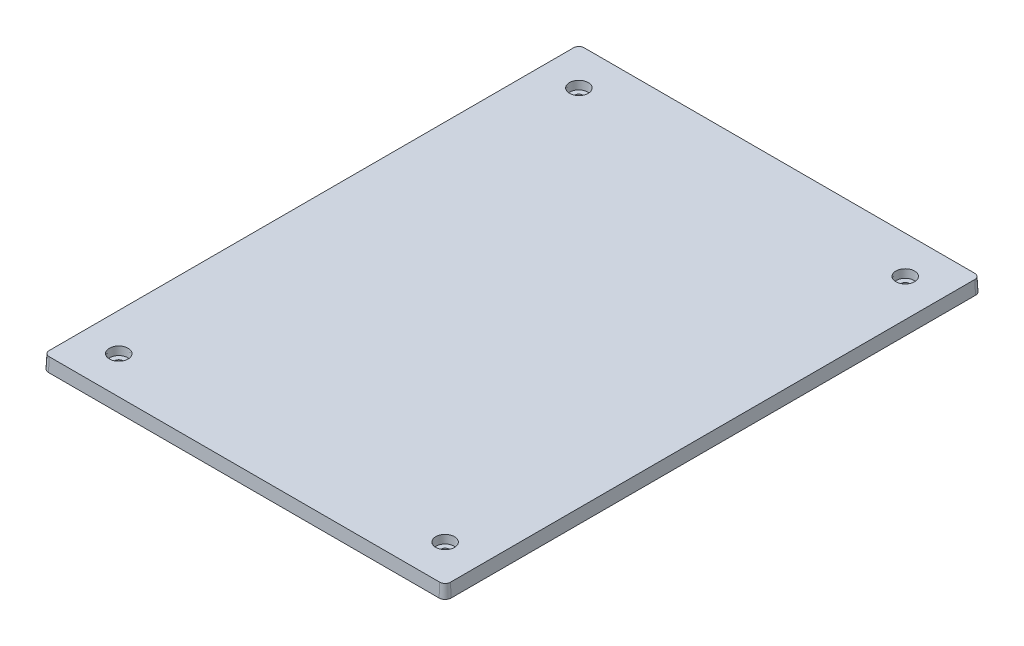
ISO-10303-21;
HEADER;
FILE_DESCRIPTION(('STEP AP214'),'2;1');
FILE_NAME('part.step','',(''),(''),'','','');
FILE_SCHEMA(('AUTOMOTIVE_DESIGN { 1 0 10303 214 1 1 1 1 }'));
ENDSEC;
DATA;
#1=APPLICATION_CONTEXT('core data for automotive mechanical design processes');
#2=APPLICATION_PROTOCOL_DEFINITION('international standard','automotive_design',2000,#1);
#3=PRODUCT_CONTEXT('',#1,'mechanical');
#4=PRODUCT('Part','Part','',(#3));
#5=PRODUCT_RELATED_PRODUCT_CATEGORY('part','',(#4));
#6=PRODUCT_DEFINITION_FORMATION('','',#4);
#7=PRODUCT_DEFINITION_CONTEXT('part definition',#1,'design');
#8=PRODUCT_DEFINITION('design','',#6,#7);
#9=PRODUCT_DEFINITION_SHAPE('','',#8);
#10=(LENGTH_UNIT() NAMED_UNIT(*) SI_UNIT(.MILLI.,.METRE.));
#11=(NAMED_UNIT(*) PLANE_ANGLE_UNIT() SI_UNIT($,.RADIAN.));
#12=(NAMED_UNIT(*) SI_UNIT($,.STERADIAN.) SOLID_ANGLE_UNIT());
#13=UNCERTAINTY_MEASURE_WITH_UNIT(LENGTH_MEASURE(1.E-05),#10,'distance_accuracy_value','');
#14=(GEOMETRIC_REPRESENTATION_CONTEXT(3) GLOBAL_UNCERTAINTY_ASSIGNED_CONTEXT((#13)) GLOBAL_UNIT_ASSIGNED_CONTEXT((#10,
#11,#12)) REPRESENTATION_CONTEXT('',''));
#15=CARTESIAN_POINT('',(0.,0.,0.));
#16=DIRECTION('',(0.,0.,1.));
#17=DIRECTION('',(1.,0.,0.));
#18=AXIS2_PLACEMENT_3D('',#15,#16,#17);
#19=CARTESIAN_POINT('',(-211.142788133925,5.,-160.073110132883));
#20=DIRECTION('',(0.,1.,0.));
#21=DIRECTION('',(0.,0.,1.));
#22=AXIS2_PLACEMENT_3D('',#19,#20,#21);
#23=CONICAL_SURFACE('',#22,1.59999999999999,0.05235987755983);
#24=CARTESIAN_POINT('',(-211.142788133925,0.,-160.073110132883));
#25=DIRECTION('',(0.,1.,0.));
#26=DIRECTION('',(0.,0.,1.));
#27=AXIS2_PLACEMENT_3D('',#24,#25,#26);
#28=CIRCLE('',#27,1.33796110358478);
#29=CARTESIAN_POINT('',(-211.142788133925,0.,-158.735149029298));
#30=VERTEX_POINT('',#29);
#31=EDGE_CURVE('E204',#30,#30,#28,.F.);
#32=ORIENTED_EDGE('',*,*,#31,.T.);
#33=EDGE_LOOP('',(#32));
#34=FACE_BOUND('',#33,.T.);
#35=CARTESIAN_POINT('',(-211.142788133925,2.,-160.073110132883));
#36=DIRECTION('',(0.,1.,0.));
#37=DIRECTION('',(0.,0.,1.));
#38=AXIS2_PLACEMENT_3D('',#35,#36,#37);
#39=CIRCLE('',#38,1.44277666215086);
#40=CARTESIAN_POINT('',(-211.142788133925,2.,-158.630333470732));
#41=VERTEX_POINT('',#40);
#42=EDGE_CURVE('E41',#41,#41,#39,.F.);
#43=ORIENTED_EDGE('',*,*,#42,.F.);
#44=EDGE_LOOP('',(#43));
#45=FACE_BOUND('',#44,.T.);
#46=ADVANCED_FACE('F37',(#34,#45),#23,.F.);
#47=CARTESIAN_POINT('',(-333.142788133925,5.,11.9268898671168));
#48=DIRECTION('',(0.,1.,0.));
#49=DIRECTION('',(0.,0.,1.));
#50=AXIS2_PLACEMENT_3D('',#47,#48,#49);
#51=CONICAL_SURFACE('',#50,1.59999999999996,0.05235987755983);
#52=CARTESIAN_POINT('',(-333.142788133925,0.,11.9268898671168));
#53=DIRECTION('',(0.,1.,0.));
#54=DIRECTION('',(0.,0.,1.));
#55=AXIS2_PLACEMENT_3D('',#52,#53,#54);
#56=CIRCLE('',#55,1.33796110358476);
#57=CARTESIAN_POINT('',(-333.142788133925,0.,13.2648509707016));
#58=VERTEX_POINT('',#57);
#59=EDGE_CURVE('E231',#58,#58,#56,.F.);
#60=ORIENTED_EDGE('',*,*,#59,.T.);
#61=EDGE_LOOP('',(#60));
#62=FACE_BOUND('',#61,.T.);
#63=CARTESIAN_POINT('',(-333.142788133925,2.,11.9268898671168));
#64=DIRECTION('',(0.,1.,0.));
#65=DIRECTION('',(0.,0.,1.));
#66=AXIS2_PLACEMENT_3D('',#63,#64,#65);
#67=CIRCLE('',#66,1.44277666215084);
#68=CARTESIAN_POINT('',(-333.142788133925,2.,13.3696665292676));
#69=VERTEX_POINT('',#68);
#70=EDGE_CURVE('E228',#69,#69,#67,.F.);
#71=ORIENTED_EDGE('',*,*,#70,.F.);
#72=EDGE_LOOP('',(#71));
#73=FACE_BOUND('',#72,.T.);
#74=ADVANCED_FACE('F317',(#62,#73),#51,.F.);
#75=CARTESIAN_POINT('',(-211.142788133925,5.,11.9268898671168));
#76=DIRECTION('',(0.,1.,0.));
#77=DIRECTION('',(0.,0.,1.));
#78=AXIS2_PLACEMENT_3D('',#75,#76,#77);
#79=CONICAL_SURFACE('',#78,1.60000000000002,0.05235987755983);
#80=CARTESIAN_POINT('',(-211.142788133925,0.,11.9268898671168));
#81=DIRECTION('',(0.,1.,0.));
#82=DIRECTION('',(0.,0.,1.));
#83=AXIS2_PLACEMENT_3D('',#80,#81,#82);
#84=CIRCLE('',#83,1.33796110358481);
#85=CARTESIAN_POINT('',(-211.142788133925,0.,13.2648509707016));
#86=VERTEX_POINT('',#85);
#87=EDGE_CURVE('E212',#86,#86,#84,.F.);
#88=ORIENTED_EDGE('',*,*,#87,.T.);
#89=EDGE_LOOP('',(#88));
#90=FACE_BOUND('',#89,.T.);
#91=CARTESIAN_POINT('',(-211.142788133925,2.,11.9268898671168));
#92=DIRECTION('',(0.,1.,0.));
#93=DIRECTION('',(0.,0.,1.));
#94=AXIS2_PLACEMENT_3D('',#91,#92,#93);
#95=CIRCLE('',#94,1.4427766621509);
#96=CARTESIAN_POINT('',(-211.142788133925,2.,13.3696665292677));
#97=VERTEX_POINT('',#96);
#98=EDGE_CURVE('E221',#97,#97,#95,.F.);
#99=ORIENTED_EDGE('',*,*,#98,.F.);
#100=EDGE_LOOP('',(#99));
#101=FACE_BOUND('',#100,.T.);
#102=ADVANCED_FACE('F313',(#90,#101),#79,.F.);
#103=CARTESIAN_POINT('',(-333.142788133925,5.,-160.073110132883));
#104=DIRECTION('',(0.,1.,0.));
#105=DIRECTION('',(0.,0.,1.));
#106=AXIS2_PLACEMENT_3D('',#103,#104,#105);
#107=CONICAL_SURFACE('',#106,1.59999999999996,0.05235987755983);
#108=CARTESIAN_POINT('',(-333.142788133925,0.,-160.073110132883));
#109=DIRECTION('',(0.,1.,0.));
#110=DIRECTION('',(0.,0.,1.));
#111=AXIS2_PLACEMENT_3D('',#108,#109,#110);
#112=CIRCLE('',#111,1.33796110358476);
#113=CARTESIAN_POINT('',(-333.142788133925,0.,-158.735149029298));
#114=VERTEX_POINT('',#113);
#115=EDGE_CURVE('E208',#114,#114,#112,.F.);
#116=ORIENTED_EDGE('',*,*,#115,.T.);
#117=EDGE_LOOP('',(#116));
#118=FACE_BOUND('',#117,.T.);
#119=CARTESIAN_POINT('',(-333.142788133925,2.,-160.073110132883));
#120=DIRECTION('',(0.,1.,0.));
#121=DIRECTION('',(0.,0.,1.));
#122=AXIS2_PLACEMENT_3D('',#119,#120,#121);
#123=CIRCLE('',#122,1.44277666215084);
#124=CARTESIAN_POINT('',(-333.142788133925,2.,-158.630333470732));
#125=VERTEX_POINT('',#124);
#126=EDGE_CURVE('E218',#125,#125,#123,.F.);
#127=ORIENTED_EDGE('',*,*,#126,.F.);
#128=EDGE_LOOP('',(#127));
#129=FACE_BOUND('',#128,.T.);
#130=ADVANCED_FACE('F308',(#118,#129),#107,.F.);
#131=CARTESIAN_POINT('',(-345.145529064416,-1.,-174.387556808581));
#132=CARTESIAN_POINT('',(-345.752795620197,-1.00000000000068,-174.387556808683));
#133=CARTESIAN_POINT('',(-346.3526203948,-1.,-174.138668215172));
#134=CARTESIAN_POINT('',(-347.208346216213,-1.,-173.282942393759));
#135=CARTESIAN_POINT('',(-347.457234809681,-1.00000000000068,-172.683117619156));
#136=CARTESIAN_POINT('',(-347.457234809623,-1.,-172.075851063374));
#137=CARTESIAN_POINT('',(-345.145529064416,5.,-174.073110132883));
#138=CARTESIAN_POINT('',(-345.670400123873,5.,-174.073110132876));
#139=CARTESIAN_POINT('',(-346.188541300976,5.,-173.858052555574));
#140=CARTESIAN_POINT('',(-346.927730556622,5.,-173.118863299941));
#141=CARTESIAN_POINT('',(-347.142788133866,5.,-172.600722122826));
#142=CARTESIAN_POINT('',(-347.142788133925,5.,-172.075851063374));
#143=B_SPLINE_SURFACE_WITH_KNOTS('',1,3,((#131,#132,#133,#134,#135,#136),(#137,#138,#139,#140,
#141,#142)),.UNSPECIFIED.,.F.,.F.,.F.,(2,2),(4,2,4),(0.,1.),(5.49915667165253,6.28318530717959,
7.06721394270664),.UNSPECIFIED.);
#144=CARTESIAN_POINT('',(-345.145529064419,0.,-174.335149029298));
#145=CARTESIAN_POINT('',(-345.273080732209,0.,-174.335176175184));
#146=CARTESIAN_POINT('',(-345.400490163894,0.,-174.323917418397));
#147=CARTESIAN_POINT('',(-345.651723437775,0.,-174.280147968457));
#148=CARTESIAN_POINT('',(-345.775544561616,0.,-174.247621581765));
#149=CARTESIAN_POINT('',(-346.015979416877,0.,-174.162683806524));
#150=CARTESIAN_POINT('',(-346.132600342668,0.,-174.110292653209));
#151=CARTESIAN_POINT('',(-346.355556092321,0.,-173.986920718033));
#152=CARTESIAN_POINT('',(-346.461898830093,0.,-173.915954397192));
#153=CARTESIAN_POINT('',(-346.61162776885,0.,-173.796355045471));
#154=CARTESIAN_POINT('',(-346.660153043364,0.,-173.754019049609));
#155=CARTESIAN_POINT('',(-346.753262536115,0.,-173.665192489724));
#156=CARTESIAN_POINT('',(-346.797846827515,0.,-173.618702002861));
#157=CARTESIAN_POINT('',(-346.882777866003,0.,-173.521965107104));
#158=CARTESIAN_POINT('',(-346.923122547904,0.,-173.471716887964));
#159=CARTESIAN_POINT('',(-346.999346833647,0.,-173.367957957496));
#160=CARTESIAN_POINT('',(-347.035226253117,0.,-173.314447111589));
#161=CARTESIAN_POINT('',(-347.13364650812,0.,-173.153311889042));
#162=CARTESIAN_POINT('',(-347.189865265387,0.,-173.041739945239));
#163=CARTESIAN_POINT('',(-347.283599690943,0.,-172.811128212293));
#164=CARTESIAN_POINT('',(-347.321130512744,0.,-172.692094562114));
#165=CARTESIAN_POINT('',(-347.367215755915,0.,-172.489663411313));
#166=CARTESIAN_POINT('',(-347.38124664655,0.,-172.407482715691));
#167=CARTESIAN_POINT('',(-347.400048395247,0.,-172.242170368379));
#168=CARTESIAN_POINT('',(-347.404830037697,0.,-172.15903993801));
#169=CARTESIAN_POINT('',(-347.40482703034,0.,-172.075851063374));
#170=B_SPLINE_CURVE_WITH_KNOTS('',3,(#144,#145,#146,#147,#148,#149,#150,#151,#152,#153,#154,
#155,#156,#157,#158,#159,#160,#161,#162,#163,#164,#165,#166,#167,#168,#169),.UNSPECIFIED.,.F.,
.F.,(4,2,2,2,2,2,2,2,2,2,2,2,4),(0.,0.381968936282809,0.764220048803127,1.14608282300535,
1.52764919153551,1.72063122309064,1.91360967122549,2.10668169098715,2.29976168015199,
2.67281522812565,3.04556578300755,3.29518745617468,3.54451790093966),.UNSPECIFIED.);
#171=CARTESIAN_POINT('',(-345.145529064419,0.,-174.335149029298));
#172=VERTEX_POINT('',#171);
#173=CARTESIAN_POINT('',(-347.40482703034,0.,-172.075851063374));
#174=VERTEX_POINT('',#173);
#175=EDGE_CURVE('E111',#172,#174,#170,.T.);
#176=DIRECTION('',(-0.0523359562429439,-0.998629534754574,0.));
#177=VECTOR('',#176,1.);
#178=CARTESIAN_POINT('',(-347.142788133925,5.,-172.075851063374));
#179=LINE('',#178,#177);
#180=CARTESIAN_POINT('',(-347.142788133925,5.,-172.075851063374));
#181=VERTEX_POINT('',#180);
#182=EDGE_CURVE('E11',#181,#174,#179,.T.);
#183=CARTESIAN_POINT('',(-345.145529064416,5.,-174.073110132883));
#184=CARTESIAN_POINT('',(-345.258415979635,5.,-174.073135066214));
#185=CARTESIAN_POINT('',(-345.371177809151,5.,-174.063164178115));
#186=CARTESIAN_POINT('',(-345.593523550813,5.,-174.024396005778));
#187=CARTESIAN_POINT('',(-345.703105015756,5.,-173.99558460546));
#188=CARTESIAN_POINT('',(-345.915877314435,5.,-173.920341836813));
#189=CARTESIAN_POINT('',(-346.019074436986,5.,-173.873928139504));
#190=CARTESIAN_POINT('',(-346.216342431197,5.,-173.764630202465));
#191=CARTESIAN_POINT('',(-346.31042042194,5.,-173.701758954979));
#192=CARTESIAN_POINT('',(-346.442793635134,5.,-173.595853260143));
#193=CARTESIAN_POINT('',(-346.485652555626,5.,-173.558401573085));
#194=CARTESIAN_POINT('',(-346.567884484167,5.,-173.479829184157));
#195=CARTESIAN_POINT('',(-346.607257555926,5.,-173.438708549371));
#196=CARTESIAN_POINT('',(-346.682257605807,5.,-173.35315191746));
#197=CARTESIAN_POINT('',(-346.717882751415,5.,-173.30871431652));
#198=CARTESIAN_POINT('',(-346.785185478828,5.,-173.216959182968));
#199=CARTESIAN_POINT('',(-346.81686290013,5.,-173.169641533378));
#200=CARTESIAN_POINT('',(-346.90376008951,5.,-173.027143595175));
#201=CARTESIAN_POINT('',(-346.953387606737,5.,-172.928476969013));
#202=CARTESIAN_POINT('',(-347.036101560764,5.,-172.724553345208));
#203=CARTESIAN_POINT('',(-347.069201481477,5.,-172.619301798977));
#204=CARTESIAN_POINT('',(-347.109757609808,5.,-172.440543201853));
#205=CARTESIAN_POINT('',(-347.122080574269,5.,-172.368113382249));
#206=CARTESIAN_POINT('',(-347.138592441631,5.,-172.222422376504));
#207=CARTESIAN_POINT('',(-347.142790871495,5.,-172.149162265544));
#208=CARTESIAN_POINT('',(-347.142788133925,5.,-172.075851063374));
#209=B_SPLINE_CURVE_WITH_KNOTS('',3,(#183,#184,#185,#186,#187,#188,#189,#190,#191,#192,#193,
#194,#195,#196,#197,#198,#199,#200,#201,#202,#203,#204,#205,#206,#207,#208),.UNSPECIFIED.,.F.,
.F.,(4,2,2,2,2,2,2,2,2,2,2,2,4),(0.,0.338054064021652,0.676361702576666,1.01433060784921,
1.35203350747951,1.52259777181421,1.69315891805937,1.86380307476393,2.0344541671221,
2.36423831331353,2.69375296623097,2.91373795313356,3.13346482530307),.UNSPECIFIED.);
#210=CARTESIAN_POINT('',(-345.145529064416,5.,-174.073110132883));
#211=VERTEX_POINT('',#210);
#212=EDGE_CURVE('E112',#211,#181,#209,.T.);
#213=DIRECTION('',(-7.25101938776172E-13,-0.998629534754574,-0.0523359562429432));
#214=VECTOR('',#213,1.);
#215=CARTESIAN_POINT('',(-345.145529064416,5.,-174.073110132883));
#216=LINE('',#215,#214);
#217=EDGE_CURVE('E106',#211,#172,#216,.T.);
#218=ORIENTED_EDGE('',*,*,#175,.T.);
#219=ORIENTED_EDGE('',*,*,#182,.F.);
#220=ORIENTED_EDGE('',*,*,#212,.F.);
#221=ORIENTED_EDGE('',*,*,#217,.T.);
#222=EDGE_LOOP('',(#218,#219,#220,#221));
#223=FACE_BOUND('',#222,.T.);
#224=ADVANCED_FACE('F180',(#223),#143,.F.);
#225=CARTESIAN_POINT('',(-347.142788133925,5.,-172.075851063374));
#226=DIRECTION('',(-0.998629534754574,0.0523359562429439,0.));
#227=DIRECTION('',(-0.052335956242944,-0.998629534754574,0.));
#228=AXIS2_PLACEMENT_3D('',#225,#226,#227);
#229=PLANE('',#228);
#230=DIRECTION('',(0.,0.,-1.));
#231=VECTOR('',#230,1.);
#232=CARTESIAN_POINT('',(-347.40482703034,0.,-172.075851063374));
#233=LINE('',#232,#231);
#234=CARTESIAN_POINT('',(-347.40482703034,0.,23.9296307976077));
#235=VERTEX_POINT('',#234);
#236=EDGE_CURVE('E199',#174,#235,#233,.F.);
#237=ORIENTED_EDGE('',*,*,#236,.T.);
#238=DIRECTION('',(-0.0523359562429432,-0.998629534754574,0.));
#239=VECTOR('',#238,1.);
#240=CARTESIAN_POINT('',(-347.142788133925,5.,23.9296307976077));
#241=LINE('',#240,#239);
#242=CARTESIAN_POINT('',(-347.142788133925,5.,23.9296307976077));
#243=VERTEX_POINT('',#242);
#244=EDGE_CURVE('E47',#243,#235,#241,.T.);
#245=ORIENTED_EDGE('',*,*,#244,.F.);
#246=DIRECTION('',(0.,0.,1.));
#247=VECTOR('',#246,1.);
#248=CARTESIAN_POINT('',(-347.142788133925,5.,-172.075851063374));
#249=LINE('',#248,#247);
#250=EDGE_CURVE('E114',#181,#243,#249,.T.);
#251=ORIENTED_EDGE('',*,*,#250,.F.);
#252=ORIENTED_EDGE('',*,*,#182,.T.);
#253=EDGE_LOOP('',(#237,#245,#251,#252));
#254=FACE_BOUND('',#253,.T.);
#255=ADVANCED_FACE('F174',(#254),#229,.T.);
#256=CARTESIAN_POINT('',(-347.457234809623,-1.,23.9296307976077));
#257=CARTESIAN_POINT('',(-347.457234809739,-1.00000000000068,24.5368973533922));
#258=CARTESIAN_POINT('',(-347.208346216199,-0.999999999999774,25.1367221279889));
#259=CARTESIAN_POINT('',(-346.352620394815,-1.00000000000023,25.9924479494089));
#260=CARTESIAN_POINT('',(-345.752795620186,-1.00000000000068,26.2413365429107));
#261=CARTESIAN_POINT('',(-345.145529064415,-1.,26.2413365428151));
#262=CARTESIAN_POINT('',(-347.142788133925,5.,23.9296307976077));
#263=CARTESIAN_POINT('',(-347.142788133925,5.,24.4545018570606));
#264=CARTESIAN_POINT('',(-346.927730556608,5.,24.9726430341741));
#265=CARTESIAN_POINT('',(-346.18854130099,5.,25.7118322898081));
#266=CARTESIAN_POINT('',(-345.670400123862,5.,25.9268898671004));
#267=CARTESIAN_POINT('',(-345.145529064415,5.,25.9268898671168));
#268=B_SPLINE_SURFACE_WITH_KNOTS('',1,3,((#256,#257,#258,#259,#260,#261),(#262,#263,#264,#265,
#266,#267)),.UNSPECIFIED.,.F.,.F.,.F.,(2,2),(4,2,4),(0.,1.),(5.49915667165253,6.28318530717958,
7.06721394270664),.UNSPECIFIED.);
#269=CARTESIAN_POINT('',(-347.40482703034,0.,23.9296307976077));
#270=CARTESIAN_POINT('',(-347.404854176228,0.,24.0571824653899));
#271=CARTESIAN_POINT('',(-347.393595419444,0.,24.1845918970663));
#272=CARTESIAN_POINT('',(-347.34982596951,0.,24.4358251709308));
#273=CARTESIAN_POINT('',(-347.317299582821,0.,24.5596462947636));
#274=CARTESIAN_POINT('',(-347.23236180759,0.,24.8000811500081));
#275=CARTESIAN_POINT('',(-347.179970654281,0.,24.9167020757913));
#276=CARTESIAN_POINT('',(-347.056598719121,0.,25.1396578254317));
#277=CARTESIAN_POINT('',(-346.98563239829,0.,25.2460005631991));
#278=CARTESIAN_POINT('',(-346.86603304658,0.,25.3957295019588));
#279=CARTESIAN_POINT('',(-346.823697050718,0.,25.4442547764778));
#280=CARTESIAN_POINT('',(-346.734870490834,0.,25.5373642692391));
#281=CARTESIAN_POINT('',(-346.688380003972,0.,25.5819485606448));
#282=CARTESIAN_POINT('',(-346.591643108214,0.,25.6668795991435));
#283=CARTESIAN_POINT('',(-346.541394889073,0.,25.7072242810486));
#284=CARTESIAN_POINT('',(-346.437635958604,0.,25.7834485668016));
#285=CARTESIAN_POINT('',(-346.384125112696,0.,25.8193279862766));
#286=CARTESIAN_POINT('',(-346.222989890146,0.,25.9177482412906));
#287=CARTESIAN_POINT('',(-346.111417946342,0.,25.9739669985644));
#288=CARTESIAN_POINT('',(-345.880806213393,0.,26.0677014241314));
#289=CARTESIAN_POINT('',(-345.761772563211,0.,26.1052322459378));
#290=CARTESIAN_POINT('',(-345.559341412398,0.,26.1513174891145));
#291=CARTESIAN_POINT('',(-345.477160716768,0.,26.1653483797518));
#292=CARTESIAN_POINT('',(-345.311848369439,0.,26.1841501284474));
#293=CARTESIAN_POINT('',(-345.22871793906,0.,26.1889317708947));
#294=CARTESIAN_POINT('',(-345.145529064415,0.,26.188928763532));
#295=B_SPLINE_CURVE_WITH_KNOTS('',3,(#269,#270,#271,#272,#273,#274,#275,#276,#277,#278,#279,
#280,#281,#282,#283,#284,#285,#286,#287,#288,#289,#290,#291,#292,#293,#294),.UNSPECIFIED.,.F.,
.F.,(4,2,2,2,2,2,2,2,2,2,2,2,4),(0.,0.381968936258288,0.764220048751711,1.14608282292558,
1.52764919142861,1.72063122299454,1.91360967114017,2.10668169091242,2.29976168008795,
2.67281522807345,3.04556578296684,3.29518745615972,3.54451790095112),.UNSPECIFIED.);
#296=CARTESIAN_POINT('',(-345.145529064415,0.,26.188928763532));
#297=VERTEX_POINT('',#296);
#298=EDGE_CURVE('E192',#235,#297,#295,.T.);
#299=DIRECTION('',(0.,-0.998629534754574,0.0523359562429439));
#300=VECTOR('',#299,1.);
#301=CARTESIAN_POINT('',(-345.145529064415,5.,25.9268898671168));
#302=LINE('',#301,#300);
#303=CARTESIAN_POINT('',(-345.145529064415,5.,25.9268898671168));
#304=VERTEX_POINT('',#303);
#305=EDGE_CURVE('E267',#304,#297,#302,.T.);
#306=CARTESIAN_POINT('',(-347.142788133925,5.,23.9296307976077));
#307=CARTESIAN_POINT('',(-347.142813067257,5.,24.0425177128234));
#308=CARTESIAN_POINT('',(-347.132842179159,5.,24.1552795423363));
#309=CARTESIAN_POINT('',(-347.094074006824,5.,24.3776252839913));
#310=CARTESIAN_POINT('',(-347.065262606508,5.,24.4872067489304));
#311=CARTESIAN_POINT('',(-346.990019837865,5.,24.6999790476026));
#312=CARTESIAN_POINT('',(-346.943606140559,5.,24.80317617015));
#313=CARTESIAN_POINT('',(-346.834308203527,5.,25.0004441643561));
#314=CARTESIAN_POINT('',(-346.771436956045,5.,25.0945221550967));
#315=CARTESIAN_POINT('',(-346.665531261214,5.,25.2268953682907));
#316=CARTESIAN_POINT('',(-346.628079574157,5.,25.2697542887854));
#317=CARTESIAN_POINT('',(-346.549507185228,5.,25.3519862173292));
#318=CARTESIAN_POINT('',(-346.508386550443,5.,25.3913592890902));
#319=CARTESIAN_POINT('',(-346.422829918532,5.,25.4663593389748));
#320=CARTESIAN_POINT('',(-346.378392317592,5.,25.5019844845847));
#321=CARTESIAN_POINT('',(-346.286637184041,5.,25.5692872120027));
#322=CARTESIAN_POINT('',(-346.239319534451,5.,25.6009646333074));
#323=CARTESIAN_POINT('',(-346.096821596244,5.,25.6878618226963));
#324=CARTESIAN_POINT('',(-345.998154970079,5.,25.7374893399295));
#325=CARTESIAN_POINT('',(-345.794231346264,5.,25.8202032939672));
#326=CARTESIAN_POINT('',(-345.688979800027,5.,25.8533032146846));
#327=CARTESIAN_POINT('',(-345.510221202897,5.,25.8938593430166));
#328=CARTESIAN_POINT('',(-345.437791383293,5.,25.9061823074762));
#329=CARTESIAN_POINT('',(-345.292100377547,5.,25.9226941748326));
#330=CARTESIAN_POINT('',(-345.218840266586,5.,25.9268926046934));
#331=CARTESIAN_POINT('',(-345.145529064415,5.,25.9268898671168));
#332=B_SPLINE_CURVE_WITH_KNOTS('',3,(#306,#307,#308,#309,#310,#311,#312,#313,#314,#315,#316,
#317,#318,#319,#320,#321,#322,#323,#324,#325,#326,#327,#328,#329,#330,#331),.UNSPECIFIED.,.F.,
.F.,(4,2,2,2,2,2,2,2,2,2,2,2,4),(0.,0.338054064010847,0.676361702554579,1.01433060781499,
1.35203350743324,1.52259777177116,1.69315891801963,1.86380307472782,2.03445416708955,
2.36423831330039,2.69375296623608,2.91373795313897,3.13346482531008),.UNSPECIFIED.);
#333=EDGE_CURVE('E154',#243,#304,#332,.T.);
#334=ORIENTED_EDGE('',*,*,#298,.T.);
#335=ORIENTED_EDGE('',*,*,#305,.F.);
#336=ORIENTED_EDGE('',*,*,#333,.F.);
#337=ORIENTED_EDGE('',*,*,#244,.T.);
#338=EDGE_LOOP('',(#334,#335,#336,#337));
#339=FACE_BOUND('',#338,.T.);
#340=ADVANCED_FACE('F168',(#339),#268,.F.);
#341=CARTESIAN_POINT('',(-345.145529064415,5.,25.9268898671168));
#342=DIRECTION('',(0.,0.0523359562429439,0.998629534754574));
#343=DIRECTION('',(0.,-0.998629534754574,0.052335956242944));
#344=AXIS2_PLACEMENT_3D('',#341,#342,#343);
#345=PLANE('',#344);
#346=DIRECTION('',(-1.,0.,0.));
#347=VECTOR('',#346,1.);
#348=CARTESIAN_POINT('',(-345.145529064415,0.,26.188928763532));
#349=LINE('',#348,#347);
#350=CARTESIAN_POINT('',(-199.140047203426,0.,26.188928763532));
#351=VERTEX_POINT('',#350);
#352=EDGE_CURVE('E198',#297,#351,#349,.F.);
#353=ORIENTED_EDGE('',*,*,#352,.T.);
#354=DIRECTION('',(1.63424692691568E-12,-0.998629534754574,0.0523359562429438));
#355=VECTOR('',#354,1.);
#356=CARTESIAN_POINT('',(-199.140047203434,5.,25.9268898671168));
#357=LINE('',#356,#355);
#358=CARTESIAN_POINT('',(-199.140047203434,5.,25.9268898671168));
#359=VERTEX_POINT('',#358);
#360=EDGE_CURVE('E270',#359,#351,#357,.T.);
#361=ORIENTED_EDGE('',*,*,#360,.F.);
#362=DIRECTION('',(1.,0.,0.));
#363=VECTOR('',#362,1.);
#364=CARTESIAN_POINT('',(-345.145529064415,5.,25.9268898671168));
#365=LINE('',#364,#363);
#366=EDGE_CURVE('E161',#304,#359,#365,.T.);
#367=ORIENTED_EDGE('',*,*,#366,.F.);
#368=ORIENTED_EDGE('',*,*,#305,.T.);
#369=EDGE_LOOP('',(#353,#361,#367,#368));
#370=FACE_BOUND('',#369,.T.);
#371=ADVANCED_FACE('F173',(#370),#345,.T.);
#372=CARTESIAN_POINT('',(-199.140047203434,-1.,26.241336542815));
#373=CARTESIAN_POINT('',(-198.532780647647,-1.00000000000068,26.2413365429106));
#374=CARTESIAN_POINT('',(-197.932955873056,-1.,25.9924479494089));
#375=CARTESIAN_POINT('',(-197.077230051629,-1.,25.1367221279889));
#376=CARTESIAN_POINT('',(-196.828341458146,-1.00000000000068,24.536897353392));
#377=CARTESIAN_POINT('',(-196.828341458226,-1.,23.9296307976077));
#378=CARTESIAN_POINT('',(-199.140047203434,5.,25.9268898671168));
#379=CARTESIAN_POINT('',(-198.615176143982,5.,25.9268898671004));
#380=CARTESIAN_POINT('',(-198.097034966866,5.,25.7118322898081));
#381=CARTESIAN_POINT('',(-197.357845711234,5.,24.972643034174));
#382=CARTESIAN_POINT('',(-197.142788133954,5.,24.4545018570604));
#383=CARTESIAN_POINT('',(-197.142788133925,5.,23.9296307976077));
#384=B_SPLINE_SURFACE_WITH_KNOTS('',1,3,((#372,#373,#374,#375,#376,#377),(#378,#379,#380,#381,
#382,#383)),.UNSPECIFIED.,.F.,.F.,.F.,(2,2),(4,2,4),(0.,1.),(5.49915667165253,6.28318530717958,
7.06721394270664),.UNSPECIFIED.);
#385=CARTESIAN_POINT('',(-199.140047203426,0.,26.188928763532));
#386=CARTESIAN_POINT('',(-199.012495535632,0.,26.1889559094157));
#387=CARTESIAN_POINT('',(-198.885086103945,0.,26.1776971526272));
#388=CARTESIAN_POINT('',(-198.633852830057,0.,26.1339277026841));
#389=CARTESIAN_POINT('',(-198.510031706213,0.,26.1014013159902));
#390=CARTESIAN_POINT('',(-198.269596850947,0.,26.0164635407451));
#391=CARTESIAN_POINT('',(-198.152975925153,0.,25.9640723874273));
#392=CARTESIAN_POINT('',(-197.930020175495,0.,25.8407004522453));
#393=CARTESIAN_POINT('',(-197.823677437721,0.,25.7697341314009));
#394=CARTESIAN_POINT('',(-197.673948498964,0.,25.6501347796751));
#395=CARTESIAN_POINT('',(-197.625423224452,0.,25.6077987838115));
#396=CARTESIAN_POINT('',(-197.532313731703,0.,25.5189722239259));
#397=CARTESIAN_POINT('',(-197.487729440304,0.,25.4724817370632));
#398=CARTESIAN_POINT('',(-197.402798401818,0.,25.3757448413058));
#399=CARTESIAN_POINT('',(-197.362453719919,0.,25.3254966221654));
#400=CARTESIAN_POINT('',(-197.286229434176,0.,25.221737691698));
#401=CARTESIAN_POINT('',(-197.250350014707,0.,25.1682268457913));
#402=CARTESIAN_POINT('',(-197.151929759702,0.,25.0070916232395));
#403=CARTESIAN_POINT('',(-197.095711002433,0.,24.8955196794315));
#404=CARTESIAN_POINT('',(-197.001976576877,0.,24.6649079464749));
#405=CARTESIAN_POINT('',(-196.964445755077,0.,24.5458742962902));
#406=CARTESIAN_POINT('',(-196.918360511914,0.,24.3434431454932));
#407=CARTESIAN_POINT('',(-196.904329621283,0.,24.2612624498819));
#408=CARTESIAN_POINT('',(-196.885527872595,0.,24.0959501025914));
#409=CARTESIAN_POINT('',(-196.880746230149,0.,24.0128196722324));
#410=CARTESIAN_POINT('',(-196.880749237509,0.,23.9296307976077));
#411=B_SPLINE_CURVE_WITH_KNOTS('',3,(#385,#386,#387,#388,#389,#390,#391,#392,#393,#394,#395,
#396,#397,#398,#399,#400,#401,#402,#403,#404,#405,#406,#407,#408,#409,#410),.UNSPECIFIED.,.F.,
.F.,(4,2,2,2,2,2,2,2,2,2,2,2,4),(0.,0.381968936292557,0.764220048822902,1.14608282303583,
1.52764919157647,1.72063122312982,1.91360967126295,2.10668169102309,2.29976168018641,
2.67281522817583,3.04556578307264,3.29518745620645,3.54451790093887),.UNSPECIFIED.);
#412=CARTESIAN_POINT('',(-196.880749237509,0.,23.9296307976077));
#413=VERTEX_POINT('',#412);
#414=EDGE_CURVE('E279',#351,#413,#411,.T.);
#415=DIRECTION('',(0.0523359562429439,-0.998629534754574,0.));
#416=VECTOR('',#415,1.);
#417=CARTESIAN_POINT('',(-197.142788133925,5.,23.9296307976077));
#418=LINE('',#417,#416);
#419=CARTESIAN_POINT('',(-197.142788133925,5.,23.9296307976077));
#420=VERTEX_POINT('',#419);
#421=EDGE_CURVE('E264',#420,#413,#418,.T.);
#422=CARTESIAN_POINT('',(-199.140047203434,5.,25.9268898671168));
#423=CARTESIAN_POINT('',(-199.027160288209,5.,25.9269148004457));
#424=CARTESIAN_POINT('',(-198.914398458687,5.,25.9169439123444));
#425=CARTESIAN_POINT('',(-198.692052717014,5.,25.8781757400023));
#426=CARTESIAN_POINT('',(-198.582471252066,5.,25.8493643396817));
#427=CARTESIAN_POINT('',(-198.369698953376,5.,25.7741215710281));
#428=CARTESIAN_POINT('',(-198.26650183082,5.,25.7277078737157));
#429=CARTESIAN_POINT('',(-198.0692338366,5.,25.6184099366668));
#430=CARTESIAN_POINT('',(-197.975155845854,5.,25.5555386891749));
#431=CARTESIAN_POINT('',(-197.842782632661,5.,25.4496329943312));
#432=CARTESIAN_POINT('',(-197.79992371217,5.,25.4121813072727));
#433=CARTESIAN_POINT('',(-197.717691783635,5.,25.3336089183421));
#434=CARTESIAN_POINT('',(-197.678318711879,5.,25.2924882835558));
#435=CARTESIAN_POINT('',(-197.603318662003,5.,25.206931651644));
#436=CARTESIAN_POINT('',(-197.567693516397,5.,25.1624940507039));
#437=CARTESIAN_POINT('',(-197.500390788987,5.,25.0707389171524));
#438=CARTESIAN_POINT('',(-197.468713367686,5.,25.0234212675625));
#439=CARTESIAN_POINT('',(-197.381816178306,5.,24.8809233293543));
#440=CARTESIAN_POINT('',(-197.332188661078,5.,24.7822567031872));
#441=CARTESIAN_POINT('',(-197.24947470705,5.,24.5783330793701));
#442=CARTESIAN_POINT('',(-197.216374786338,5.,24.4730815331332));
#443=CARTESIAN_POINT('',(-197.175818658017,5.,24.2943229360168));
#444=CARTESIAN_POINT('',(-197.163495693562,5.,24.2218931164264));
#445=CARTESIAN_POINT('',(-197.14698382621,5.,24.0762021107094));
#446=CARTESIAN_POINT('',(-197.14278539635,5.,24.0029419997633));
#447=CARTESIAN_POINT('',(-197.142788133925,5.,23.9296307976077));
#448=B_SPLINE_CURVE_WITH_KNOTS('',3,(#422,#423,#424,#425,#426,#427,#428,#429,#430,#431,#432,
#433,#434,#435,#436,#437,#438,#439,#440,#441,#442,#443,#444,#445,#446,#447),.UNSPECIFIED.,.F.,
.F.,(4,2,2,2,2,2,2,2,2,2,2,2,4),(0.,0.338054064038062,0.676361702611377,1.01433060790286,
1.35203350755089,1.52259777188152,1.69315891812277,1.86380307482396,2.03445416717869,
2.36423831338679,2.69375296631943,2.91373795317838,3.13346482530565),.UNSPECIFIED.);
#449=EDGE_CURVE('E162',#359,#420,#448,.T.);
#450=ORIENTED_EDGE('',*,*,#414,.T.);
#451=ORIENTED_EDGE('',*,*,#421,.F.);
#452=ORIENTED_EDGE('',*,*,#449,.F.);
#453=ORIENTED_EDGE('',*,*,#360,.T.);
#454=EDGE_LOOP('',(#450,#451,#452,#453));
#455=FACE_BOUND('',#454,.T.);
#456=ADVANCED_FACE('F176',(#455),#384,.F.);
#457=CARTESIAN_POINT('',(-197.142788133925,5.,23.9296307976077));
#458=DIRECTION('',(0.998629534754574,0.0523359562429439,0.));
#459=DIRECTION('',(-0.052335956242944,0.998629534754574,0.));
#460=AXIS2_PLACEMENT_3D('',#457,#458,#459);
#461=PLANE('',#460);
#462=DIRECTION('',(0.,0.,1.));
#463=VECTOR('',#462,1.);
#464=CARTESIAN_POINT('',(-196.880749237509,0.,23.9296307976077));
#465=LINE('',#464,#463);
#466=CARTESIAN_POINT('',(-196.880749237509,0.,-172.075851063374));
#467=VERTEX_POINT('',#466);
#468=EDGE_CURVE('E103',#413,#467,#465,.F.);
#469=ORIENTED_EDGE('',*,*,#468,.T.);
#470=DIRECTION('',(0.0523359562429432,-0.998629534754574,0.));
#471=VECTOR('',#470,1.);
#472=CARTESIAN_POINT('',(-197.142788133925,5.,-172.075851063374));
#473=LINE('',#472,#471);
#474=CARTESIAN_POINT('',(-197.142788133925,5.,-172.075851063374));
#475=VERTEX_POINT('',#474);
#476=EDGE_CURVE('E100',#475,#467,#473,.T.);
#477=ORIENTED_EDGE('',*,*,#476,.F.);
#478=DIRECTION('',(0.,0.,-1.));
#479=VECTOR('',#478,1.);
#480=CARTESIAN_POINT('',(-197.142788133925,5.,23.9296307976077));
#481=LINE('',#480,#479);
#482=EDGE_CURVE('E132',#420,#475,#481,.T.);
#483=ORIENTED_EDGE('',*,*,#482,.F.);
#484=ORIENTED_EDGE('',*,*,#421,.T.);
#485=EDGE_LOOP('',(#469,#477,#483,#484));
#486=FACE_BOUND('',#485,.T.);
#487=ADVANCED_FACE('F297',(#486),#461,.T.);
#488=CARTESIAN_POINT('',(-196.828341458226,-1.,-172.075851063374));
#489=CARTESIAN_POINT('',(-196.828341458117,-1.00000000000068,-172.683117619161));
#490=CARTESIAN_POINT('',(-197.077230051636,-0.999999999999774,-173.282942393752));
#491=CARTESIAN_POINT('',(-197.932955873049,-1.00000000000023,-174.138668215179));
#492=CARTESIAN_POINT('',(-198.532780647652,-1.00000000000068,-174.387556808691));
#493=CARTESIAN_POINT('',(-199.140047203434,-1.,-174.387556808581));
#494=CARTESIAN_POINT('',(-197.142788133925,5.,-172.075851063374));
#495=CARTESIAN_POINT('',(-197.142788133925,5.,-172.600722122826));
#496=CARTESIAN_POINT('',(-197.357845711234,5.,-173.118863299941));
#497=CARTESIAN_POINT('',(-198.097034966866,5.,-173.858052555574));
#498=CARTESIAN_POINT('',(-198.615176143981,5.,-174.073110132883));
#499=CARTESIAN_POINT('',(-199.140047203434,5.,-174.073110132883));
#500=B_SPLINE_SURFACE_WITH_KNOTS('',1,3,((#488,#489,#490,#491,#492,#493),(#494,#495,#496,#497,
#498,#499)),.UNSPECIFIED.,.F.,.F.,.F.,(2,2),(4,2,4),(0.,1.),(5.49915667165252,6.28318530717958,
7.06721394270664),.UNSPECIFIED.);
#501=CARTESIAN_POINT('',(-196.880749237509,0.,-172.075851063374));
#502=CARTESIAN_POINT('',(-196.880722091622,0.,-172.20340273116));
#503=CARTESIAN_POINT('',(-196.891980848407,0.,-172.33081216284));
#504=CARTESIAN_POINT('',(-196.935750298343,0.,-172.582045436713));
#505=CARTESIAN_POINT('',(-196.968276685033,0.,-172.70586656055));
#506=CARTESIAN_POINT('',(-197.053214460268,0.,-172.946301415802));
#507=CARTESIAN_POINT('',(-197.10560561358,0.,-173.062922341589));
#508=CARTESIAN_POINT('',(-197.228977548748,0.,-173.285878091236));
#509=CARTESIAN_POINT('',(-197.299943869584,0.,-173.392220829006));
#510=CARTESIAN_POINT('',(-197.419543221298,0.,-173.541949767763));
#511=CARTESIAN_POINT('',(-197.46187921716,0.,-173.590475042278));
#512=CARTESIAN_POINT('',(-197.550705777042,0.,-173.683584535032));
#513=CARTESIAN_POINT('',(-197.597196263903,0.,-173.728168826434));
#514=CARTESIAN_POINT('',(-197.693933159658,0.,-173.813099864927));
#515=CARTESIAN_POINT('',(-197.744181378797,0.,-173.85344454683));
#516=CARTESIAN_POINT('',(-197.847940309262,0.,-173.929668832579));
#517=CARTESIAN_POINT('',(-197.901451155167,0.,-173.965548252052));
#518=CARTESIAN_POINT('',(-198.062586377719,0.,-174.063968507069));
#519=CARTESIAN_POINT('',(-198.17415832153,0.,-174.120187264347));
#520=CARTESIAN_POINT('',(-198.404770054493,0.,-174.213921689918));
#521=CARTESIAN_POINT('',(-198.523803704682,0.,-174.251452511725));
#522=CARTESIAN_POINT('',(-198.726234855494,0.,-174.297537754895));
#523=CARTESIAN_POINT('',(-198.808415551116,0.,-174.311568645529));
#524=CARTESIAN_POINT('',(-198.973727898428,0.,-174.330370394218));
#525=CARTESIAN_POINT('',(-199.056858328798,0.,-174.335152036663));
#526=CARTESIAN_POINT('',(-199.140047203434,0.,-174.335149029298));
#527=B_SPLINE_CURVE_WITH_KNOTS('',3,(#501,#502,#503,#504,#505,#506,#507,#508,#509,#510,#511,
#512,#513,#514,#515,#516,#517,#518,#519,#520,#521,#522,#523,#524,#525,#526),.UNSPECIFIED.,.F.,
.F.,(4,2,2,2,2,2,2,2,2,2,2,2,4),(0.,0.381968936270002,0.764220048775989,1.14608282296389,
1.52764919148018,1.72063122303657,1.91360967117273,2.10668169093586,2.2997616801022,
2.67281522810923,3.04556578302315,3.29518745618911,3.54451790095438),.UNSPECIFIED.);
#528=CARTESIAN_POINT('',(-199.140047203434,0.,-174.335149029298));
#529=VERTEX_POINT('',#528);
#530=EDGE_CURVE('E95',#467,#529,#527,.T.);
#531=DIRECTION('',(0.,-0.998629534754574,-0.0523359562429439));
#532=VECTOR('',#531,1.);
#533=CARTESIAN_POINT('',(-199.140047203434,5.,-174.073110132883));
#534=LINE('',#533,#532);
#535=CARTESIAN_POINT('',(-199.140047203434,5.,-174.073110132883));
#536=VERTEX_POINT('',#535);
#537=EDGE_CURVE('E98',#536,#529,#534,.T.);
#538=CARTESIAN_POINT('',(-197.142788133925,5.,-172.075851063374));
#539=CARTESIAN_POINT('',(-197.142763200592,5.,-172.18873797859));
#540=CARTESIAN_POINT('',(-197.15273408869,5.,-172.301499808103));
#541=CARTESIAN_POINT('',(-197.191502261024,5.,-172.523845549758));
#542=CARTESIAN_POINT('',(-197.22031366134,5.,-172.633427014698));
#543=CARTESIAN_POINT('',(-197.295556429983,5.,-172.846199313371));
#544=CARTESIAN_POINT('',(-197.341970127288,5.,-172.949396435919));
#545=CARTESIAN_POINT('',(-197.451268064321,5.,-173.146664430126));
#546=CARTESIAN_POINT('',(-197.514139311804,5.,-173.240742420866));
#547=CARTESIAN_POINT('',(-197.620045006634,5.,-173.373115634058));
#548=CARTESIAN_POINT('',(-197.657496693691,5.,-173.415974554551));
#549=CARTESIAN_POINT('',(-197.736069082617,5.,-173.498206483092));
#550=CARTESIAN_POINT('',(-197.777189717401,5.,-173.537579554851));
#551=CARTESIAN_POINT('',(-197.862746349309,5.,-173.612579604733));
#552=CARTESIAN_POINT('',(-197.907183950247,5.,-173.648204750343));
#553=CARTESIAN_POINT('',(-197.998939083795,5.,-173.71550747776));
#554=CARTESIAN_POINT('',(-198.046256733383,5.,-173.747184899064));
#555=CARTESIAN_POINT('',(-198.188754671591,5.,-173.834082088458));
#556=CARTESIAN_POINT('',(-198.287421297761,5.,-173.883709605696));
#557=CARTESIAN_POINT('',(-198.491344921586,5.,-173.966423559741));
#558=CARTESIAN_POINT('',(-198.596596467828,5.,-173.999523480461));
#559=CARTESIAN_POINT('',(-198.775355064962,5.,-174.040079608792));
#560=CARTESIAN_POINT('',(-198.847784884565,5.,-174.05240257325));
#561=CARTESIAN_POINT('',(-198.993475890307,5.,-174.068914440603));
#562=CARTESIAN_POINT('',(-199.066736001265,5.,-174.073112870462));
#563=CARTESIAN_POINT('',(-199.140047203434,5.,-174.073110132883));
#564=B_SPLINE_CURVE_WITH_KNOTS('',3,(#538,#539,#540,#541,#542,#543,#544,#545,#546,#547,#548,
#549,#550,#551,#552,#553,#554,#555,#556,#557,#558,#559,#560,#561,#562,#563),.UNSPECIFIED.,.F.,
.F.,(4,2,2,2,2,2,2,2,2,2,2,2,4),(0.,0.338054064011204,0.676361702555682,1.01433060781746,
1.35203350743659,1.52259777176877,1.69315891801162,1.86380307471444,2.03445416707084,
2.36423831329978,2.69375296625275,2.9137379531487,3.13346482531372),.UNSPECIFIED.);
#565=EDGE_CURVE('E125',#475,#536,#564,.T.);
#566=ORIENTED_EDGE('',*,*,#530,.T.);
#567=ORIENTED_EDGE('',*,*,#537,.F.);
#568=ORIENTED_EDGE('',*,*,#565,.F.);
#569=ORIENTED_EDGE('',*,*,#476,.T.);
#570=EDGE_LOOP('',(#566,#567,#568,#569));
#571=FACE_BOUND('',#570,.T.);
#572=ADVANCED_FACE('F96',(#571),#500,.F.);
#573=CARTESIAN_POINT('',(-199.140047203434,5.,-174.073110132883));
#574=DIRECTION('',(0.,0.0523359562429439,-0.998629534754574));
#575=DIRECTION('',(0.,0.998629534754574,0.052335956242944));
#576=AXIS2_PLACEMENT_3D('',#573,#574,#575);
#577=PLANE('',#576);
#578=DIRECTION('',(1.,0.,0.));
#579=VECTOR('',#578,1.);
#580=CARTESIAN_POINT('',(-199.140047203434,0.,-174.335149029298));
#581=LINE('',#580,#579);
#582=EDGE_CURVE('E85',#529,#172,#581,.F.);
#583=ORIENTED_EDGE('',*,*,#582,.T.);
#584=ORIENTED_EDGE('',*,*,#217,.F.);
#585=DIRECTION('',(-1.,0.,0.));
#586=VECTOR('',#585,1.);
#587=CARTESIAN_POINT('',(-199.140047203434,5.,-174.073110132883));
#588=LINE('',#587,#586);
#589=EDGE_CURVE('E56',#536,#211,#588,.T.);
#590=ORIENTED_EDGE('',*,*,#589,.F.);
#591=ORIENTED_EDGE('',*,*,#537,.T.);
#592=EDGE_LOOP('',(#583,#584,#590,#591));
#593=FACE_BOUND('',#592,.T.);
#594=ADVANCED_FACE('F105',(#593),#577,.T.);
#595=CARTESIAN_POINT('',(-345.140043441929,5.,-172.070365440887));
#596=DIRECTION('',(0.,1.,0.));
#597=DIRECTION('',(0.,0.,1.));
#598=AXIS2_PLACEMENT_3D('',#595,#596,#597);
#599=PLANE('',#598);
#600=CARTESIAN_POINT('',(-333.142788133925,5.,11.9268898671168));
#601=DIRECTION('',(0.,1.,0.));
#602=DIRECTION('',(0.,0.,1.));
#603=AXIS2_PLACEMENT_3D('',#600,#601,#602);
#604=CIRCLE('',#603,3.50000000000002);
#605=CARTESIAN_POINT('',(-333.142788133925,5.,15.4268898671168));
#606=VERTEX_POINT('',#605);
#607=EDGE_CURVE('E227',#606,#606,#604,.T.);
#608=ORIENTED_EDGE('',*,*,#607,.F.);
#609=EDGE_LOOP('',(#608));
#610=FACE_BOUND('',#609,.T.);
#611=CARTESIAN_POINT('',(-211.142788133925,5.,11.9268898671168));
#612=DIRECTION('',(0.,1.,0.));
#613=DIRECTION('',(0.,0.,1.));
#614=AXIS2_PLACEMENT_3D('',#611,#612,#613);
#615=CIRCLE('',#614,3.49999999999999);
#616=CARTESIAN_POINT('',(-211.142788133925,5.,15.4268898671168));
#617=VERTEX_POINT('',#616);
#618=EDGE_CURVE('E226',#617,#617,#615,.T.);
#619=ORIENTED_EDGE('',*,*,#618,.F.);
#620=EDGE_LOOP('',(#619));
#621=FACE_BOUND('',#620,.T.);
#622=CARTESIAN_POINT('',(-211.142788133925,5.,-160.073110132883));
#623=DIRECTION('',(0.,1.,0.));
#624=DIRECTION('',(0.,0.,1.));
#625=AXIS2_PLACEMENT_3D('',#622,#623,#624);
#626=CIRCLE('',#625,3.49999999999999);
#627=CARTESIAN_POINT('',(-211.142788133925,5.,-156.573110132883));
#628=VERTEX_POINT('',#627);
#629=EDGE_CURVE('E240',#628,#628,#626,.T.);
#630=ORIENTED_EDGE('',*,*,#629,.F.);
#631=EDGE_LOOP('',(#630));
#632=FACE_BOUND('',#631,.T.);
#633=CARTESIAN_POINT('',(-333.142788133925,5.,-160.073110132883));
#634=DIRECTION('',(0.,1.,0.));
#635=DIRECTION('',(0.,0.,1.));
#636=AXIS2_PLACEMENT_3D('',#633,#634,#635);
#637=CIRCLE('',#636,3.50000000000002);
#638=CARTESIAN_POINT('',(-333.142788133925,5.,-156.573110132883));
#639=VERTEX_POINT('',#638);
#640=EDGE_CURVE('E219',#639,#639,#637,.T.);
#641=ORIENTED_EDGE('',*,*,#640,.F.);
#642=EDGE_LOOP('',(#641));
#643=FACE_BOUND('',#642,.T.);
#644=ORIENTED_EDGE('',*,*,#212,.T.);
#645=ORIENTED_EDGE('',*,*,#250,.T.);
#646=ORIENTED_EDGE('',*,*,#333,.T.);
#647=ORIENTED_EDGE('',*,*,#366,.T.);
#648=ORIENTED_EDGE('',*,*,#449,.T.);
#649=ORIENTED_EDGE('',*,*,#482,.T.);
#650=ORIENTED_EDGE('',*,*,#565,.T.);
#651=ORIENTED_EDGE('',*,*,#589,.T.);
#652=EDGE_LOOP('',(#644,#645,#646,#647,#648,#649,#650,#651));
#653=FACE_BOUND('',#652,.T.);
#654=ADVANCED_FACE('F142',(#610,#621,#632,#643,#653),#599,.T.);
#655=CARTESIAN_POINT('',(-345.140043441929,0.,-172.070365440887));
#656=DIRECTION('',(0.,1.,0.));
#657=DIRECTION('',(0.,0.,1.));
#658=AXIS2_PLACEMENT_3D('',#655,#656,#657);
#659=PLANE('',#658);
#660=ORIENTED_EDGE('',*,*,#115,.F.);
#661=EDGE_LOOP('',(#660));
#662=FACE_BOUND('',#661,.T.);
#663=ORIENTED_EDGE('',*,*,#87,.F.);
#664=EDGE_LOOP('',(#663));
#665=FACE_BOUND('',#664,.T.);
#666=ORIENTED_EDGE('',*,*,#59,.F.);
#667=EDGE_LOOP('',(#666));
#668=FACE_BOUND('',#667,.T.);
#669=ORIENTED_EDGE('',*,*,#31,.F.);
#670=EDGE_LOOP('',(#669));
#671=FACE_BOUND('',#670,.T.);
#672=ORIENTED_EDGE('',*,*,#175,.F.);
#673=ORIENTED_EDGE('',*,*,#582,.F.);
#674=ORIENTED_EDGE('',*,*,#530,.F.);
#675=ORIENTED_EDGE('',*,*,#468,.F.);
#676=ORIENTED_EDGE('',*,*,#414,.F.);
#677=ORIENTED_EDGE('',*,*,#352,.F.);
#678=ORIENTED_EDGE('',*,*,#298,.F.);
#679=ORIENTED_EDGE('',*,*,#236,.F.);
#680=EDGE_LOOP('',(#672,#673,#674,#675,#676,#677,#678,#679));
#681=FACE_BOUND('',#680,.T.);
#682=ADVANCED_FACE('F109',(#662,#665,#668,#671,#681),#659,.F.);
#683=CARTESIAN_POINT('',(-333.142788133925,2.,-160.073110132883));
#684=DIRECTION('',(0.,1.,0.));
#685=DIRECTION('',(0.,0.,1.));
#686=AXIS2_PLACEMENT_3D('',#683,#684,#685);
#687=PLANE('',#686);
#688=CARTESIAN_POINT('',(-333.142788133925,2.,-160.073110132883));
#689=DIRECTION('',(0.,1.,0.));
#690=DIRECTION('',(0.,0.,1.));
#691=AXIS2_PLACEMENT_3D('',#688,#689,#690);
#692=CIRCLE('',#691,3.3427766621509);
#693=CARTESIAN_POINT('',(-333.142788133925,2.,-156.730333470732));
#694=VERTEX_POINT('',#693);
#695=EDGE_CURVE('E215',#694,#694,#692,.T.);
#696=ORIENTED_EDGE('',*,*,#695,.T.);
#697=EDGE_LOOP('',(#696));
#698=FACE_BOUND('',#697,.T.);
#699=ORIENTED_EDGE('',*,*,#126,.T.);
#700=EDGE_LOOP('',(#699));
#701=FACE_BOUND('',#700,.T.);
#702=ADVANCED_FACE('F147',(#698,#701),#687,.T.);
#703=CARTESIAN_POINT('',(-333.142788133925,5.,-160.073110132883));
#704=DIRECTION('',(0.,1.,0.));
#705=DIRECTION('',(0.,0.,1.));
#706=AXIS2_PLACEMENT_3D('',#703,#704,#705);
#707=CONICAL_SURFACE('',#706,3.50000000000002,0.05235987755983);
#708=ORIENTED_EDGE('',*,*,#695,.F.);
#709=EDGE_LOOP('',(#708));
#710=FACE_BOUND('',#709,.T.);
#711=ORIENTED_EDGE('',*,*,#640,.T.);
#712=EDGE_LOOP('',(#711));
#713=FACE_BOUND('',#712,.T.);
#714=ADVANCED_FACE('F329',(#710,#713),#707,.F.);
#715=CARTESIAN_POINT('',(-211.142788133925,2.,11.9268898671168));
#716=DIRECTION('',(0.,1.,0.));
#717=DIRECTION('',(0.,0.,1.));
#718=AXIS2_PLACEMENT_3D('',#715,#716,#717);
#719=PLANE('',#718);
#720=CARTESIAN_POINT('',(-211.142788133925,2.,11.9268898671168));
#721=DIRECTION('',(0.,1.,0.));
#722=DIRECTION('',(0.,0.,1.));
#723=AXIS2_PLACEMENT_3D('',#720,#721,#722);
#724=CIRCLE('',#723,3.34277666215087);
#725=CARTESIAN_POINT('',(-211.142788133925,2.,15.2696665292677));
#726=VERTEX_POINT('',#725);
#727=EDGE_CURVE('E238',#726,#726,#724,.T.);
#728=ORIENTED_EDGE('',*,*,#727,.T.);
#729=EDGE_LOOP('',(#728));
#730=FACE_BOUND('',#729,.T.);
#731=ORIENTED_EDGE('',*,*,#98,.T.);
#732=EDGE_LOOP('',(#731));
#733=FACE_BOUND('',#732,.T.);
#734=ADVANCED_FACE('F331',(#730,#733),#719,.T.);
#735=CARTESIAN_POINT('',(-211.142788133925,5.,11.9268898671168));
#736=DIRECTION('',(0.,1.,0.));
#737=DIRECTION('',(0.,0.,1.));
#738=AXIS2_PLACEMENT_3D('',#735,#736,#737);
#739=CONICAL_SURFACE('',#738,3.49999999999999,0.05235987755983);
#740=ORIENTED_EDGE('',*,*,#727,.F.);
#741=EDGE_LOOP('',(#740));
#742=FACE_BOUND('',#741,.T.);
#743=ORIENTED_EDGE('',*,*,#618,.T.);
#744=EDGE_LOOP('',(#743));
#745=FACE_BOUND('',#744,.T.);
#746=ADVANCED_FACE('F39',(#742,#745),#739,.F.);
#747=CARTESIAN_POINT('',(-333.142788133925,2.,11.9268898671168));
#748=DIRECTION('',(0.,1.,0.));
#749=DIRECTION('',(0.,0.,1.));
#750=AXIS2_PLACEMENT_3D('',#747,#748,#749);
#751=PLANE('',#750);
#752=CARTESIAN_POINT('',(-333.142788133925,2.,11.9268898671168));
#753=DIRECTION('',(0.,1.,0.));
#754=DIRECTION('',(0.,0.,1.));
#755=AXIS2_PLACEMENT_3D('',#752,#753,#754);
#756=CIRCLE('',#755,3.3427766621509);
#757=CARTESIAN_POINT('',(-333.142788133925,2.,15.2696665292677));
#758=VERTEX_POINT('',#757);
#759=EDGE_CURVE('E223',#758,#758,#756,.T.);
#760=ORIENTED_EDGE('',*,*,#759,.T.);
#761=EDGE_LOOP('',(#760));
#762=FACE_BOUND('',#761,.T.);
#763=ORIENTED_EDGE('',*,*,#70,.T.);
#764=EDGE_LOOP('',(#763));
#765=FACE_BOUND('',#764,.T.);
#766=ADVANCED_FACE('F337',(#762,#765),#751,.T.);
#767=CARTESIAN_POINT('',(-333.142788133925,5.,11.9268898671168));
#768=DIRECTION('',(0.,1.,0.));
#769=DIRECTION('',(0.,0.,1.));
#770=AXIS2_PLACEMENT_3D('',#767,#768,#769);
#771=CONICAL_SURFACE('',#770,3.50000000000002,0.05235987755983);
#772=ORIENTED_EDGE('',*,*,#759,.F.);
#773=EDGE_LOOP('',(#772));
#774=FACE_BOUND('',#773,.T.);
#775=ORIENTED_EDGE('',*,*,#607,.T.);
#776=EDGE_LOOP('',(#775));
#777=FACE_BOUND('',#776,.T.);
#778=ADVANCED_FACE('F334',(#774,#777),#771,.F.);
#779=CARTESIAN_POINT('',(-211.142788133925,2.,-160.073110132883));
#780=DIRECTION('',(0.,1.,0.));
#781=DIRECTION('',(0.,0.,1.));
#782=AXIS2_PLACEMENT_3D('',#779,#780,#781);
#783=PLANE('',#782);
#784=CARTESIAN_POINT('',(-211.142788133925,2.,-160.073110132883));
#785=DIRECTION('',(0.,1.,0.));
#786=DIRECTION('',(0.,0.,1.));
#787=AXIS2_PLACEMENT_3D('',#784,#785,#786);
#788=CIRCLE('',#787,3.34277666215087);
#789=CARTESIAN_POINT('',(-211.142788133925,2.,-156.730333470732));
#790=VERTEX_POINT('',#789);
#791=EDGE_CURVE('E241',#790,#790,#788,.T.);
#792=ORIENTED_EDGE('',*,*,#791,.T.);
#793=EDGE_LOOP('',(#792));
#794=FACE_BOUND('',#793,.T.);
#795=ORIENTED_EDGE('',*,*,#42,.T.);
#796=EDGE_LOOP('',(#795));
#797=FACE_BOUND('',#796,.T.);
#798=ADVANCED_FACE('F336',(#794,#797),#783,.T.);
#799=CARTESIAN_POINT('',(-211.142788133925,5.,-160.073110132883));
#800=DIRECTION('',(0.,1.,0.));
#801=DIRECTION('',(0.,0.,1.));
#802=AXIS2_PLACEMENT_3D('',#799,#800,#801);
#803=CONICAL_SURFACE('',#802,3.49999999999999,0.05235987755983);
#804=ORIENTED_EDGE('',*,*,#791,.F.);
#805=EDGE_LOOP('',(#804));
#806=FACE_BOUND('',#805,.T.);
#807=ORIENTED_EDGE('',*,*,#629,.T.);
#808=EDGE_LOOP('',(#807));
#809=FACE_BOUND('',#808,.T.);
#810=ADVANCED_FACE('F327',(#806,#809),#803,.F.);
#811=CLOSED_SHELL('',(#46,#74,#102,#130,#224,#255,#340,#371,#456,#487,#572,#594,#654,#682,#702,
#714,#734,#746,#766,#778,#798,#810));
#812=MANIFOLD_SOLID_BREP('B2',#811);
#813=ADVANCED_BREP_SHAPE_REPRESENTATION('',(#18,#812),#14);
#814=SHAPE_DEFINITION_REPRESENTATION(#9,#813);
ENDSEC;
END-ISO-10303-21;
